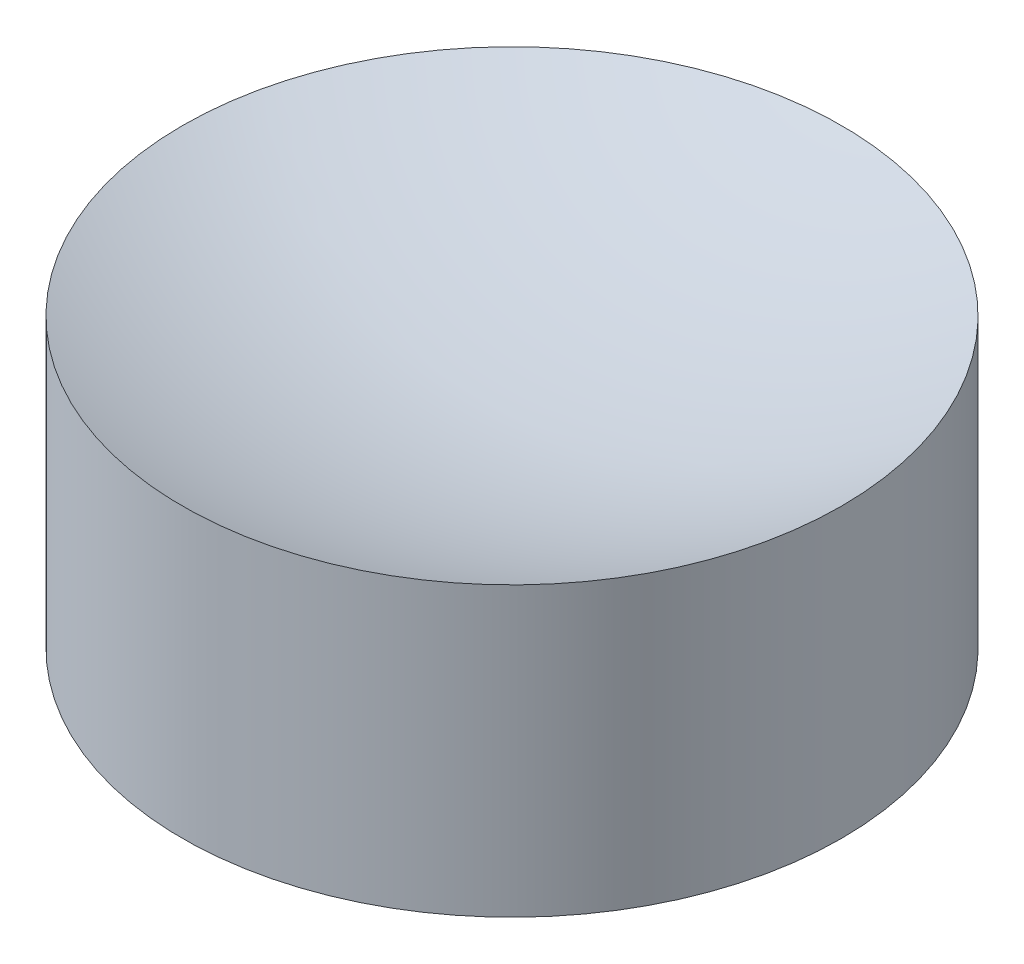
ISO-10303-21;
HEADER;
FILE_DESCRIPTION(('STEP AP214'),'2;1');
FILE_NAME('part.step','',(''),(''),'','','');
FILE_SCHEMA(('AUTOMOTIVE_DESIGN { 1 0 10303 214 1 1 1 1 }'));
ENDSEC;
DATA;
#1=APPLICATION_CONTEXT('core data for automotive mechanical design processes');
#2=APPLICATION_PROTOCOL_DEFINITION('international standard','automotive_design',2000,#1);
#3=PRODUCT_CONTEXT('',#1,'mechanical');
#4=PRODUCT('Part','Part','',(#3));
#5=PRODUCT_RELATED_PRODUCT_CATEGORY('part','',(#4));
#6=PRODUCT_DEFINITION_FORMATION('','',#4);
#7=PRODUCT_DEFINITION_CONTEXT('part definition',#1,'design');
#8=PRODUCT_DEFINITION('design','',#6,#7);
#9=PRODUCT_DEFINITION_SHAPE('','',#8);
#10=(LENGTH_UNIT() NAMED_UNIT(*) SI_UNIT(.MILLI.,.METRE.));
#11=(NAMED_UNIT(*) PLANE_ANGLE_UNIT() SI_UNIT($,.RADIAN.));
#12=(NAMED_UNIT(*) SI_UNIT($,.STERADIAN.) SOLID_ANGLE_UNIT());
#13=UNCERTAINTY_MEASURE_WITH_UNIT(LENGTH_MEASURE(1.E-05),#10,'distance_accuracy_value','');
#14=(GEOMETRIC_REPRESENTATION_CONTEXT(3) GLOBAL_UNCERTAINTY_ASSIGNED_CONTEXT((#13)) GLOBAL_UNIT_ASSIGNED_CONTEXT((#10,
#11,#12)) REPRESENTATION_CONTEXT('',''));
#15=CARTESIAN_POINT('',(0.,0.,0.));
#16=DIRECTION('',(0.,0.,1.));
#17=DIRECTION('',(1.,0.,0.));
#18=AXIS2_PLACEMENT_3D('',#15,#16,#17);
#19=CARTESIAN_POINT('',(-2.27373675443232E-12,3680.32840285752,-699.260009999996));
#20=DIRECTION('',(0.,0.,1.));
#21=DIRECTION('',(0.,1.,0.));
#22=AXIS2_PLACEMENT_3D('',#19,#20,#21);
#23=SPHERICAL_SURFACE('',#22,1756.47985239597);
#24=CARTESIAN_POINT('',(-9.22262421865E-13,5435.41286574612,-699.260009999996));
#25=DIRECTION('',(0.,-1.,0.));
#26=DIRECTION('',(1.,0.,0.));
#27=AXIS2_PLACEMENT_3D('',#24,#25,#26);
#28=CIRCLE('',#27,70.);
#29=CARTESIAN_POINT('',(69.9999999999991,5435.41286574612,-699.260009999996));
#30=VERTEX_POINT('',#29);
#31=EDGE_CURVE('E19',#30,#30,#28,.F.);
#32=ORIENTED_EDGE('',*,*,#31,.F.);
#33=EDGE_LOOP('',(#32));
#34=FACE_BOUND('',#33,.T.);
#35=ADVANCED_FACE('F15',(#34),#23,.F.);
#36=CARTESIAN_POINT('',(0.,5655.35451552389,-699.260009999996));
#37=DIRECTION('',(0.,0.,1.));
#38=DIRECTION('',(0.,-1.,0.));
#39=AXIS2_PLACEMENT_3D('',#36,#37,#38);
#40=SPHERICAL_SURFACE('',#39,173.546260270407);
#41=CARTESIAN_POINT('',(-1.27897692436806E-13,5496.55179371522,-699.260009999996));
#42=DIRECTION('',(0.,-1.,0.));
#43=DIRECTION('',(1.,0.,0.));
#44=AXIS2_PLACEMENT_3D('',#41,#42,#43);
#45=CIRCLE('',#44,70.);
#46=CARTESIAN_POINT('',(69.9999999999999,5496.55179371522,-699.260009999996));
#47=VERTEX_POINT('',#46);
#48=EDGE_CURVE('E10',#47,#47,#45,.T.);
#49=ORIENTED_EDGE('',*,*,#48,.F.);
#50=EDGE_LOOP('',(#49));
#51=FACE_BOUND('',#50,.T.);
#52=ADVANCED_FACE('F30',(#51),#40,.F.);
#53=CARTESIAN_POINT('',(-1.27897692436818E-13,5496.55179371522,-699.260009999996));
#54=DIRECTION('',(0.,-1.,0.));
#55=DIRECTION('',(1.,0.,0.));
#56=AXIS2_PLACEMENT_3D('',#53,#54,#55);
#57=CYLINDRICAL_SURFACE('',#56,70.);
#58=ORIENTED_EDGE('',*,*,#48,.T.);
#59=EDGE_LOOP('',(#58));
#60=FACE_BOUND('',#59,.T.);
#61=ORIENTED_EDGE('',*,*,#31,.T.);
#62=EDGE_LOOP('',(#61));
#63=FACE_BOUND('',#62,.T.);
#64=ADVANCED_FACE('F17',(#60,#63),#57,.T.);
#65=CLOSED_SHELL('',(#35,#52,#64));
#66=MANIFOLD_SOLID_BREP('B1',#65);
#67=ADVANCED_BREP_SHAPE_REPRESENTATION('',(#18,#66),#14);
#68=SHAPE_DEFINITION_REPRESENTATION(#9,#67);
ENDSEC;
END-ISO-10303-21;
